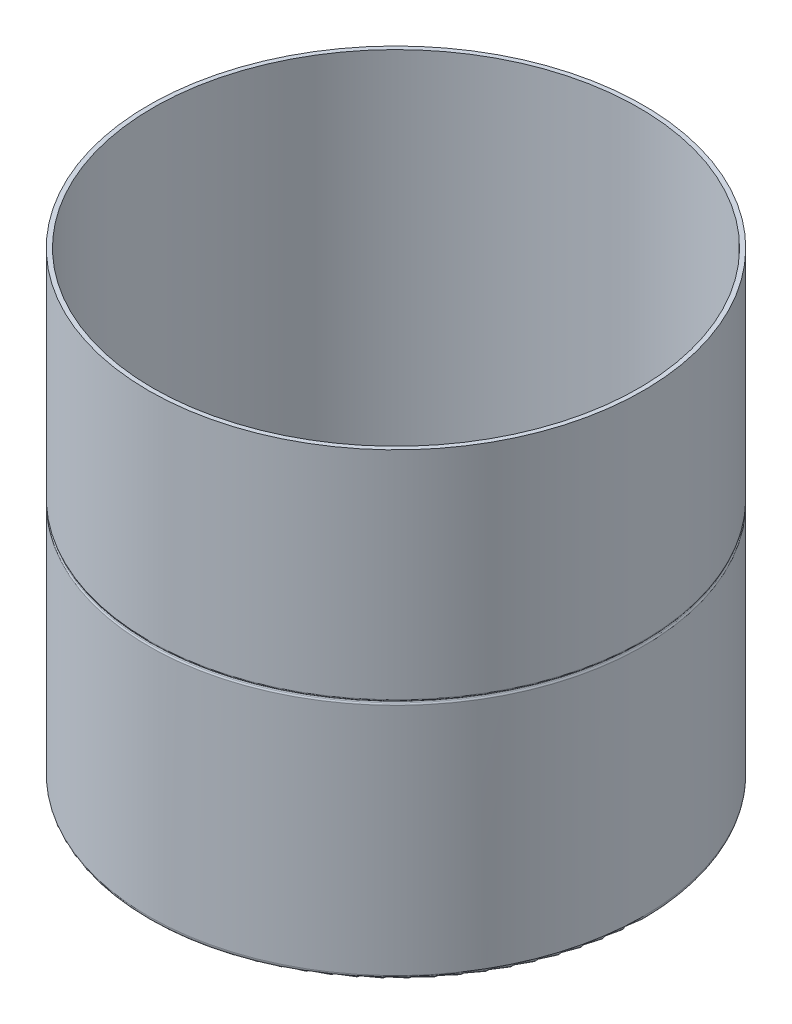
ISO-10303-21;
HEADER;
FILE_DESCRIPTION(('STEP AP214'),'2;1');
FILE_NAME('part.step','',(''),(''),'','','');
FILE_SCHEMA(('AUTOMOTIVE_DESIGN { 1 0 10303 214 1 1 1 1 }'));
ENDSEC;
DATA;
#1=APPLICATION_CONTEXT('core data for automotive mechanical design processes');
#2=APPLICATION_PROTOCOL_DEFINITION('international standard','automotive_design',2000,#1);
#3=PRODUCT_CONTEXT('',#1,'mechanical');
#4=PRODUCT('Part','Part','',(#3));
#5=PRODUCT_RELATED_PRODUCT_CATEGORY('part','',(#4));
#6=PRODUCT_DEFINITION_FORMATION('','',#4);
#7=PRODUCT_DEFINITION_CONTEXT('part definition',#1,'design');
#8=PRODUCT_DEFINITION('design','',#6,#7);
#9=PRODUCT_DEFINITION_SHAPE('','',#8);
#10=(LENGTH_UNIT() NAMED_UNIT(*) SI_UNIT(.MILLI.,.METRE.));
#11=(NAMED_UNIT(*) PLANE_ANGLE_UNIT() SI_UNIT($,.RADIAN.));
#12=(NAMED_UNIT(*) SI_UNIT($,.STERADIAN.) SOLID_ANGLE_UNIT());
#13=UNCERTAINTY_MEASURE_WITH_UNIT(LENGTH_MEASURE(1.E-05),#10,'distance_accuracy_value','');
#14=(GEOMETRIC_REPRESENTATION_CONTEXT(3) GLOBAL_UNCERTAINTY_ASSIGNED_CONTEXT((#13)) GLOBAL_UNIT_ASSIGNED_CONTEXT((#10,
#11,#12)) REPRESENTATION_CONTEXT('',''));
#15=CARTESIAN_POINT('',(0.,0.,0.));
#16=DIRECTION('',(0.,0.,1.));
#17=DIRECTION('',(1.,0.,0.));
#18=AXIS2_PLACEMENT_3D('',#15,#16,#17);
#19=CARTESIAN_POINT('',(0.,105.,0.));
#20=DIRECTION('',(0.,-1.,0.));
#21=DIRECTION('',(0.,0.,-1.));
#22=AXIS2_PLACEMENT_3D('',#19,#20,#21);
#23=CYLINDRICAL_SURFACE('',#22,56.5);
#24=CARTESIAN_POINT('',(0.,55.559016994375,0.));
#25=DIRECTION('',(0.,1.,0.));
#26=DIRECTION('',(0.,0.,1.));
#27=AXIS2_PLACEMENT_3D('',#24,#25,#26);
#28=CIRCLE('',#27,56.5);
#29=CARTESIAN_POINT('',(0.,55.559016994375,56.5));
#30=VERTEX_POINT('',#29);
#31=EDGE_CURVE('E10',#30,#30,#28,.T.);
#32=ORIENTED_EDGE('',*,*,#31,.T.);
#33=EDGE_LOOP('',(#32));
#34=FACE_BOUND('',#33,.T.);
#35=CARTESIAN_POINT('',(0.,105.,0.));
#36=DIRECTION('',(0.,1.,0.));
#37=DIRECTION('',(0.,0.,1.));
#38=AXIS2_PLACEMENT_3D('',#35,#36,#37);
#39=CIRCLE('',#38,56.5);
#40=CARTESIAN_POINT('',(0.,105.,56.5));
#41=VERTEX_POINT('',#40);
#42=EDGE_CURVE('E71',#41,#41,#39,.T.);
#43=ORIENTED_EDGE('',*,*,#42,.F.);
#44=EDGE_LOOP('',(#43));
#45=FACE_BOUND('',#44,.T.);
#46=ADVANCED_FACE('F39',(#34,#45),#23,.T.);
#47=CARTESIAN_POINT('',(0.,54.4409830056251,0.));
#48=DIRECTION('',(0.,-1.,0.));
#49=DIRECTION('',(0.,0.,-1.));
#50=AXIS2_PLACEMENT_3D('',#47,#48,#49);
#51=CIRCLE('',#50,56.5);
#52=CARTESIAN_POINT('',(0.,54.4409830056251,-56.5));
#53=VERTEX_POINT('',#52);
#54=EDGE_CURVE('E50',#53,#53,#51,.T.);
#55=ORIENTED_EDGE('',*,*,#54,.T.);
#56=EDGE_LOOP('',(#55));
#57=FACE_BOUND('',#56,.T.);
#58=CARTESIAN_POINT('',(0.,1.,0.));
#59=DIRECTION('',(0.,1.,0.));
#60=DIRECTION('',(0.,0.,1.));
#61=AXIS2_PLACEMENT_3D('',#58,#59,#60);
#62=CIRCLE('',#61,56.5);
#63=CARTESIAN_POINT('',(0.,1.,56.5));
#64=VERTEX_POINT('',#63);
#65=EDGE_CURVE('E62',#64,#64,#62,.T.);
#66=ORIENTED_EDGE('',*,*,#65,.T.);
#67=EDGE_LOOP('',(#66));
#68=FACE_BOUND('',#67,.T.);
#69=ADVANCED_FACE('F127',(#57,#68),#23,.T.);
#70=CARTESIAN_POINT('',(0.,105.,0.));
#71=DIRECTION('',(0.,1.,0.));
#72=DIRECTION('',(0.,0.,1.));
#73=AXIS2_PLACEMENT_3D('',#70,#71,#72);
#74=PLANE('',#73);
#75=CARTESIAN_POINT('',(0.,105.,0.));
#76=DIRECTION('',(0.,1.,0.));
#77=DIRECTION('',(0.,0.,1.));
#78=AXIS2_PLACEMENT_3D('',#75,#76,#77);
#79=CIRCLE('',#78,55.5);
#80=CARTESIAN_POINT('',(0.,105.,55.5));
#81=VERTEX_POINT('',#80);
#82=EDGE_CURVE('E75',#81,#81,#79,.T.);
#83=ORIENTED_EDGE('',*,*,#82,.F.);
#84=EDGE_LOOP('',(#83));
#85=FACE_BOUND('',#84,.T.);
#86=ORIENTED_EDGE('',*,*,#42,.T.);
#87=EDGE_LOOP('',(#86));
#88=FACE_BOUND('',#87,.T.);
#89=ADVANCED_FACE('F111',(#85,#88),#74,.T.);
#90=CARTESIAN_POINT('',(0.,0.,0.));
#91=DIRECTION('',(0.,1.,0.));
#92=DIRECTION('',(0.,0.,1.));
#93=AXIS2_PLACEMENT_3D('',#90,#91,#92);
#94=PLANE('',#93);
#95=CARTESIAN_POINT('',(0.,0.,0.));
#96=DIRECTION('',(0.,1.,0.));
#97=DIRECTION('',(0.,0.,1.));
#98=AXIS2_PLACEMENT_3D('',#95,#96,#97);
#99=CIRCLE('',#98,55.5);
#100=CARTESIAN_POINT('',(0.,0.,55.5));
#101=VERTEX_POINT('',#100);
#102=EDGE_CURVE('E59',#101,#101,#99,.F.);
#103=ORIENTED_EDGE('',*,*,#102,.T.);
#104=EDGE_LOOP('',(#103));
#105=FACE_BOUND('',#104,.T.);
#106=CARTESIAN_POINT('',(0.,0.,0.));
#107=DIRECTION('',(0.,1.,0.));
#108=DIRECTION('',(0.,0.,1.));
#109=AXIS2_PLACEMENT_3D('',#106,#107,#108);
#110=CIRCLE('',#109,27.);
#111=CARTESIAN_POINT('',(0.,0.,27.));
#112=VERTEX_POINT('',#111);
#113=EDGE_CURVE('E65',#112,#112,#110,.T.);
#114=ORIENTED_EDGE('',*,*,#113,.T.);
#115=EDGE_LOOP('',(#114));
#116=FACE_BOUND('',#115,.T.);
#117=CARTESIAN_POINT('',(44.,0.,0.));
#118=DIRECTION('',(0.,-1.,0.));
#119=DIRECTION('',(0.,0.,-1.));
#120=AXIS2_PLACEMENT_3D('',#117,#118,#119);
#121=CIRCLE('',#120,2.5);
#122=CARTESIAN_POINT('',(44.,0.,-2.5));
#123=VERTEX_POINT('',#122);
#124=EDGE_CURVE('E90',#123,#123,#121,.T.);
#125=ORIENTED_EDGE('',*,*,#124,.F.);
#126=EDGE_LOOP('',(#125));
#127=FACE_BOUND('',#126,.T.);
#128=CARTESIAN_POINT('',(-44.,0.,0.));
#129=DIRECTION('',(0.,-1.,0.));
#130=DIRECTION('',(0.,0.,-1.));
#131=AXIS2_PLACEMENT_3D('',#128,#129,#130);
#132=CIRCLE('',#131,2.5);
#133=CARTESIAN_POINT('',(-44.,0.,-2.5));
#134=VERTEX_POINT('',#133);
#135=EDGE_CURVE('E87',#134,#134,#132,.T.);
#136=ORIENTED_EDGE('',*,*,#135,.F.);
#137=EDGE_LOOP('',(#136));
#138=FACE_BOUND('',#137,.T.);
#139=ADVANCED_FACE('F107',(#105,#116,#127,#138),#94,.F.);
#140=CARTESIAN_POINT('',(0.,5.,0.));
#141=DIRECTION('',(0.,1.,0.));
#142=DIRECTION('',(0.,0.,1.));
#143=AXIS2_PLACEMENT_3D('',#140,#141,#142);
#144=CYLINDRICAL_SURFACE('',#143,55.5);
#145=CARTESIAN_POINT('',(0.,5.,0.));
#146=DIRECTION('',(0.,1.,0.));
#147=DIRECTION('',(0.,0.,1.));
#148=AXIS2_PLACEMENT_3D('',#145,#146,#147);
#149=CIRCLE('',#148,55.5);
#150=CARTESIAN_POINT('',(0.,5.,55.5));
#151=VERTEX_POINT('',#150);
#152=EDGE_CURVE('E74',#151,#151,#149,.T.);
#153=CARTESIAN_POINT('',(0.,5.,55.5));
#154=CARTESIAN_POINT('',(0.,6.04166666666667,55.5));
#155=CARTESIAN_POINT('',(0.,7.08333333333334,55.5));
#156=CARTESIAN_POINT('',(0.,9.16666666666667,55.5));
#157=CARTESIAN_POINT('',(0.,10.2083333333333,55.5));
#158=CARTESIAN_POINT('',(0.,12.2916666666667,55.5));
#159=CARTESIAN_POINT('',(0.,13.3333333333333,55.5));
#160=CARTESIAN_POINT('',(0.,15.4166666666667,55.5));
#161=CARTESIAN_POINT('',(0.,16.4583333333333,55.5));
#162=CARTESIAN_POINT('',(0.,18.5416666666667,55.5));
#163=CARTESIAN_POINT('',(0.,19.5833333333333,55.5));
#164=CARTESIAN_POINT('',(0.,21.6666666666667,55.5));
#165=CARTESIAN_POINT('',(0.,22.7083333333333,55.5));
#166=CARTESIAN_POINT('',(0.,24.7916666666667,55.5));
#167=CARTESIAN_POINT('',(0.,25.8333333333333,55.5));
#168=CARTESIAN_POINT('',(0.,27.9166666666667,55.5));
#169=CARTESIAN_POINT('',(0.,28.9583333333333,55.5));
#170=CARTESIAN_POINT('',(0.,31.0416666666667,55.5));
#171=CARTESIAN_POINT('',(0.,32.0833333333333,55.5));
#172=CARTESIAN_POINT('',(0.,34.1666666666667,55.5));
#173=CARTESIAN_POINT('',(0.,35.2083333333333,55.5));
#174=CARTESIAN_POINT('',(0.,37.2916666666667,55.5));
#175=CARTESIAN_POINT('',(0.,38.3333333333333,55.5));
#176=CARTESIAN_POINT('',(0.,40.4166666666667,55.5));
#177=CARTESIAN_POINT('',(0.,41.4583333333333,55.5));
#178=CARTESIAN_POINT('',(0.,43.5416666666667,55.5));
#179=CARTESIAN_POINT('',(0.,44.5833333333333,55.5));
#180=CARTESIAN_POINT('',(0.,46.6666666666667,55.5));
#181=CARTESIAN_POINT('',(0.,47.7083333333333,55.5));
#182=CARTESIAN_POINT('',(0.,49.7916666666667,55.5));
#183=CARTESIAN_POINT('',(0.,50.8333333333333,55.5));
#184=CARTESIAN_POINT('',(0.,52.9166666666667,55.5));
#185=CARTESIAN_POINT('',(0.,53.9583333333333,55.5));
#186=CARTESIAN_POINT('',(0.,56.0416666666667,55.5));
#187=CARTESIAN_POINT('',(0.,57.0833333333333,55.5));
#188=CARTESIAN_POINT('',(0.,59.1666666666667,55.5));
#189=CARTESIAN_POINT('',(0.,60.2083333333333,55.5));
#190=CARTESIAN_POINT('',(0.,62.2916666666667,55.5));
#191=CARTESIAN_POINT('',(0.,63.3333333333333,55.5));
#192=CARTESIAN_POINT('',(0.,65.4166666666667,55.5));
#193=CARTESIAN_POINT('',(0.,66.4583333333333,55.5));
#194=CARTESIAN_POINT('',(0.,68.5416666666667,55.5));
#195=CARTESIAN_POINT('',(0.,69.5833333333333,55.5));
#196=CARTESIAN_POINT('',(0.,71.6666666666667,55.5));
#197=CARTESIAN_POINT('',(0.,72.7083333333333,55.5));
#198=CARTESIAN_POINT('',(0.,74.7916666666667,55.5));
#199=CARTESIAN_POINT('',(0.,75.8333333333333,55.5));
#200=CARTESIAN_POINT('',(0.,77.9166666666667,55.5));
#201=CARTESIAN_POINT('',(0.,78.9583333333333,55.5));
#202=CARTESIAN_POINT('',(0.,81.0416666666667,55.5));
#203=CARTESIAN_POINT('',(0.,82.0833333333333,55.5));
#204=CARTESIAN_POINT('',(0.,84.1666666666667,55.5));
#205=CARTESIAN_POINT('',(0.,85.2083333333333,55.5));
#206=CARTESIAN_POINT('',(0.,87.2916666666667,55.5));
#207=CARTESIAN_POINT('',(0.,88.3333333333333,55.5));
#208=CARTESIAN_POINT('',(0.,90.4166666666667,55.5));
#209=CARTESIAN_POINT('',(0.,91.4583333333333,55.5));
#210=CARTESIAN_POINT('',(0.,93.5416666666667,55.5));
#211=CARTESIAN_POINT('',(0.,94.5833333333333,55.5));
#212=CARTESIAN_POINT('',(0.,96.6666666666667,55.5));
#213=CARTESIAN_POINT('',(0.,97.7083333333333,55.5));
#214=CARTESIAN_POINT('',(0.,99.7916666666667,55.5));
#215=CARTESIAN_POINT('',(0.,100.833333333333,55.5));
#216=CARTESIAN_POINT('',(0.,102.916666666667,55.5));
#217=CARTESIAN_POINT('',(0.,103.958333333333,55.5));
#218=CARTESIAN_POINT('',(0.,105.,55.5));
#219=B_SPLINE_CURVE_WITH_KNOTS('',3,(#153,#154,#155,#156,#157,#158,#159,#160,#161,#162,#163,
#164,#165,#166,#167,#168,#169,#170,#171,#172,#173,#174,#175,#176,#177,#178,#179,#180,#181,#182,
#183,#184,#185,#186,#187,#188,#189,#190,#191,#192,#193,#194,#195,#196,#197,#198,#199,#200,#201,
#202,#203,#204,#205,#206,#207,#208,#209,#210,#211,#212,#213,#214,#215,#216,#217,#218),
.UNSPECIFIED.,.F.,.F.,(4,2,2,2,2,2,2,2,2,2,2,2,2,2,2,2,2,2,2,2,2,2,2,2,2,2,2,2,2,2,2,2,4),(0.,
3.125,6.25,9.375,12.5,15.625,18.75,21.875,25.,28.125,31.25,34.375,37.5,40.625,43.75,46.875,50.,
53.125,56.25,59.375,62.5,65.625,68.75,71.875,75.,78.125,81.25,84.375,87.5,90.625,93.75,96.875,
100.),.UNSPECIFIED.);
#220=EDGE_CURVE('BSEAM110',#151,#81,#219,.T.);
#221=ORIENTED_EDGE('',*,*,#152,.F.);
#222=ORIENTED_EDGE('',*,*,#82,.T.);
#223=ORIENTED_EDGE('',*,*,#220,.T.);
#224=ORIENTED_EDGE('',*,*,#220,.F.);
#225=EDGE_LOOP('',(#221,#223,#222,#224));
#226=FACE_BOUND('',#225,.T.);
#227=ADVANCED_FACE('F110',(#226),#144,.F.);
#228=CARTESIAN_POINT('',(0.,5.,0.));
#229=DIRECTION('',(0.,1.,0.));
#230=DIRECTION('',(0.,0.,1.));
#231=AXIS2_PLACEMENT_3D('',#228,#229,#230);
#232=PLANE('',#231);
#233=CARTESIAN_POINT('',(44.,4.99999999999994,0.));
#234=DIRECTION('',(0.,-1.,0.));
#235=DIRECTION('',(0.,0.,-1.));
#236=AXIS2_PLACEMENT_3D('',#233,#234,#235);
#237=CIRCLE('',#236,2.5);
#238=CARTESIAN_POINT('',(44.,4.99999999999994,-2.5));
#239=VERTEX_POINT('',#238);
#240=EDGE_CURVE('E83',#239,#239,#237,.T.);
#241=ORIENTED_EDGE('',*,*,#240,.T.);
#242=EDGE_LOOP('',(#241));
#243=FACE_BOUND('',#242,.T.);
#244=CARTESIAN_POINT('',(-44.,4.99999999999994,0.));
#245=DIRECTION('',(0.,-1.,0.));
#246=DIRECTION('',(0.,0.,-1.));
#247=AXIS2_PLACEMENT_3D('',#244,#245,#246);
#248=CIRCLE('',#247,2.5);
#249=CARTESIAN_POINT('',(-44.,4.99999999999994,-2.5));
#250=VERTEX_POINT('',#249);
#251=EDGE_CURVE('E84',#250,#250,#248,.T.);
#252=ORIENTED_EDGE('',*,*,#251,.T.);
#253=EDGE_LOOP('',(#252));
#254=FACE_BOUND('',#253,.T.);
#255=CARTESIAN_POINT('',(0.,4.99999999999994,0.));
#256=DIRECTION('',(0.,-1.,0.));
#257=DIRECTION('',(0.,0.,-1.));
#258=AXIS2_PLACEMENT_3D('',#255,#256,#257);
#259=CIRCLE('',#258,25.);
#260=CARTESIAN_POINT('',(0.,4.99999999999994,-25.));
#261=VERTEX_POINT('',#260);
#262=EDGE_CURVE('E78',#261,#261,#259,.T.);
#263=ORIENTED_EDGE('',*,*,#262,.T.);
#264=EDGE_LOOP('',(#263));
#265=FACE_BOUND('',#264,.T.);
#266=ORIENTED_EDGE('',*,*,#152,.T.);
#267=EDGE_LOOP('',(#266));
#268=FACE_BOUND('',#267,.T.);
#269=ADVANCED_FACE('F96',(#243,#254,#265,#268),#232,.T.);
#270=CARTESIAN_POINT('',(0.,4.99999999999994,0.));
#271=DIRECTION('',(0.,-1.,0.));
#272=DIRECTION('',(0.,0.,-1.));
#273=AXIS2_PLACEMENT_3D('',#270,#271,#272);
#274=CYLINDRICAL_SURFACE('',#273,25.);
#275=CARTESIAN_POINT('',(0.,2.,0.));
#276=DIRECTION('',(0.,1.,0.));
#277=DIRECTION('',(0.,0.,1.));
#278=AXIS2_PLACEMENT_3D('',#275,#276,#277);
#279=CIRCLE('',#278,25.);
#280=CARTESIAN_POINT('',(0.,2.,25.));
#281=VERTEX_POINT('',#280);
#282=EDGE_CURVE('E68',#281,#281,#279,.F.);
#283=ORIENTED_EDGE('',*,*,#282,.T.);
#284=EDGE_LOOP('',(#283));
#285=FACE_BOUND('',#284,.T.);
#286=ORIENTED_EDGE('',*,*,#262,.F.);
#287=EDGE_LOOP('',(#286));
#288=FACE_BOUND('',#287,.T.);
#289=ADVANCED_FACE('F117',(#285,#288),#274,.F.);
#290=CARTESIAN_POINT('',(-44.,4.99999999999994,0.));
#291=DIRECTION('',(0.,-1.,0.));
#292=DIRECTION('',(0.,0.,-1.));
#293=AXIS2_PLACEMENT_3D('',#290,#291,#292);
#294=CYLINDRICAL_SURFACE('',#293,2.5);
#295=ORIENTED_EDGE('',*,*,#251,.F.);
#296=EDGE_LOOP('',(#295));
#297=FACE_BOUND('',#296,.T.);
#298=ORIENTED_EDGE('',*,*,#135,.T.);
#299=EDGE_LOOP('',(#298));
#300=FACE_BOUND('',#299,.T.);
#301=ADVANCED_FACE('F103',(#297,#300),#294,.F.);
#302=CARTESIAN_POINT('',(44.,4.99999999999994,0.));
#303=DIRECTION('',(0.,-1.,0.));
#304=DIRECTION('',(0.,0.,-1.));
#305=AXIS2_PLACEMENT_3D('',#302,#303,#304);
#306=CYLINDRICAL_SURFACE('',#305,2.5);
#307=ORIENTED_EDGE('',*,*,#240,.F.);
#308=EDGE_LOOP('',(#307));
#309=FACE_BOUND('',#308,.T.);
#310=ORIENTED_EDGE('',*,*,#124,.T.);
#311=EDGE_LOOP('',(#310));
#312=FACE_BOUND('',#311,.T.);
#313=ADVANCED_FACE('F99',(#309,#312),#306,.F.);
#314=CARTESIAN_POINT('',(0.,55.,0.));
#315=DIRECTION('',(0.,1.,0.));
#316=DIRECTION('',(0.,0.,1.));
#317=AXIS2_PLACEMENT_3D('',#314,#315,#316);
#318=TOROIDAL_SURFACE('',#317,56.5,0.25);
#319=CARTESIAN_POINT('',(0.,55.1863389981244,0.));
#320=DIRECTION('',(0.,-1.,0.));
#321=DIRECTION('',(0.,0.,-1.));
#322=AXIS2_PLACEMENT_3D('',#319,#320,#321);
#323=CIRCLE('',#322,56.3333333333339);
#324=CARTESIAN_POINT('',(0.,55.1863389981244,-56.3333333333339));
#325=VERTEX_POINT('',#324);
#326=EDGE_CURVE('E46',#325,#325,#323,.T.);
#327=ORIENTED_EDGE('',*,*,#326,.T.);
#328=EDGE_LOOP('',(#327));
#329=FACE_BOUND('',#328,.T.);
#330=CARTESIAN_POINT('',(0.,54.8136610018756,0.));
#331=DIRECTION('',(0.,1.,0.));
#332=DIRECTION('',(0.,0.,1.));
#333=AXIS2_PLACEMENT_3D('',#330,#331,#332);
#334=CIRCLE('',#333,56.3333333333339);
#335=CARTESIAN_POINT('',(0.,54.8136610018756,56.3333333333339));
#336=VERTEX_POINT('',#335);
#337=EDGE_CURVE('E54',#336,#336,#334,.T.);
#338=ORIENTED_EDGE('',*,*,#337,.T.);
#339=EDGE_LOOP('',(#338));
#340=FACE_BOUND('',#339,.T.);
#341=ADVANCED_FACE('F102',(#329,#340),#318,.F.);
#342=CARTESIAN_POINT('',(0.,2.,0.));
#343=DIRECTION('',(0.,1.,0.));
#344=DIRECTION('',(0.,0.,1.));
#345=AXIS2_PLACEMENT_3D('',#342,#343,#344);
#346=TOROIDAL_SURFACE('',#345,27.,2.);
#347=ORIENTED_EDGE('',*,*,#113,.F.);
#348=EDGE_LOOP('',(#347));
#349=FACE_BOUND('',#348,.T.);
#350=ORIENTED_EDGE('',*,*,#282,.F.);
#351=EDGE_LOOP('',(#350));
#352=FACE_BOUND('',#351,.T.);
#353=ADVANCED_FACE('F136',(#349,#352),#346,.T.);
#354=CARTESIAN_POINT('',(0.,1.,0.));
#355=DIRECTION('',(0.,1.,0.));
#356=DIRECTION('',(0.,0.,1.));
#357=AXIS2_PLACEMENT_3D('',#354,#355,#356);
#358=TOROIDAL_SURFACE('',#357,55.5,1.);
#359=ORIENTED_EDGE('',*,*,#102,.F.);
#360=EDGE_LOOP('',(#359));
#361=FACE_BOUND('',#360,.T.);
#362=ORIENTED_EDGE('',*,*,#65,.F.);
#363=EDGE_LOOP('',(#362));
#364=FACE_BOUND('',#363,.T.);
#365=ADVANCED_FACE('F139',(#361,#364),#358,.T.);
#366=CARTESIAN_POINT('',(0.,54.4409830056251,0.));
#367=DIRECTION('',(0.,-1.,0.));
#368=DIRECTION('',(0.,0.,-1.));
#369=AXIS2_PLACEMENT_3D('',#366,#367,#368);
#370=TOROIDAL_SURFACE('',#369,56.,0.5);
#371=ORIENTED_EDGE('',*,*,#54,.F.);
#372=EDGE_LOOP('',(#371));
#373=FACE_BOUND('',#372,.T.);
#374=ORIENTED_EDGE('',*,*,#337,.F.);
#375=EDGE_LOOP('',(#374));
#376=FACE_BOUND('',#375,.T.);
#377=ADVANCED_FACE('F142',(#373,#376),#370,.T.);
#378=CARTESIAN_POINT('',(0.,55.559016994375,0.));
#379=DIRECTION('',(0.,1.,0.));
#380=DIRECTION('',(0.,0.,1.));
#381=AXIS2_PLACEMENT_3D('',#378,#379,#380);
#382=TOROIDAL_SURFACE('',#381,56.,0.5);
#383=ORIENTED_EDGE('',*,*,#31,.F.);
#384=EDGE_LOOP('',(#383));
#385=FACE_BOUND('',#384,.T.);
#386=ORIENTED_EDGE('',*,*,#326,.F.);
#387=EDGE_LOOP('',(#386));
#388=FACE_BOUND('',#387,.T.);
#389=ADVANCED_FACE('F41',(#385,#388),#382,.T.);
#390=CLOSED_SHELL('',(#46,#69,#89,#139,#227,#269,#289,#301,#313,#341,#353,#365,#377,#389));
#391=MANIFOLD_SOLID_BREP('B2',#390);
#392=ADVANCED_BREP_SHAPE_REPRESENTATION('',(#18,#391),#14);
#393=SHAPE_DEFINITION_REPRESENTATION(#9,#392);
ENDSEC;
END-ISO-10303-21;
